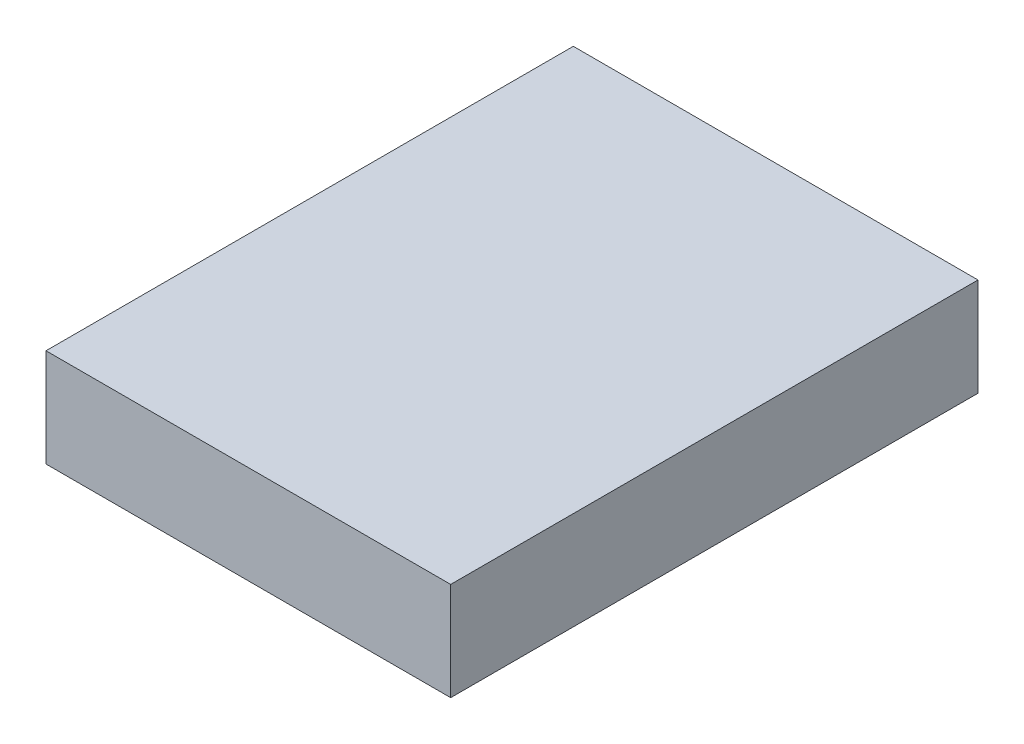
ISO-10303-21;
HEADER;
FILE_DESCRIPTION(('STEP AP214'),'2;1');
FILE_NAME('part.step','',(''),(''),'','','');
FILE_SCHEMA(('AUTOMOTIVE_DESIGN { 1 0 10303 214 1 1 1 1 }'));
ENDSEC;
DATA;
#1=APPLICATION_CONTEXT('core data for automotive mechanical design processes');
#2=APPLICATION_PROTOCOL_DEFINITION('international standard','automotive_design',2000,#1);
#3=PRODUCT_CONTEXT('',#1,'mechanical');
#4=PRODUCT('Part','Part','',(#3));
#5=PRODUCT_RELATED_PRODUCT_CATEGORY('part','',(#4));
#6=PRODUCT_DEFINITION_FORMATION('','',#4);
#7=PRODUCT_DEFINITION_CONTEXT('part definition',#1,'design');
#8=PRODUCT_DEFINITION('design','',#6,#7);
#9=PRODUCT_DEFINITION_SHAPE('','',#8);
#10=(LENGTH_UNIT() NAMED_UNIT(*) SI_UNIT(.MILLI.,.METRE.));
#11=(NAMED_UNIT(*) PLANE_ANGLE_UNIT() SI_UNIT($,.RADIAN.));
#12=(NAMED_UNIT(*) SI_UNIT($,.STERADIAN.) SOLID_ANGLE_UNIT());
#13=UNCERTAINTY_MEASURE_WITH_UNIT(LENGTH_MEASURE(1.E-05),#10,'distance_accuracy_value','');
#14=(GEOMETRIC_REPRESENTATION_CONTEXT(3) GLOBAL_UNCERTAINTY_ASSIGNED_CONTEXT((#13)) GLOBAL_UNIT_ASSIGNED_CONTEXT((#10,
#11,#12)) REPRESENTATION_CONTEXT('',''));
#15=CARTESIAN_POINT('',(0.,0.,0.));
#16=DIRECTION('',(0.,0.,1.));
#17=DIRECTION('',(1.,0.,0.));
#18=AXIS2_PLACEMENT_3D('',#15,#16,#17);
#19=CARTESIAN_POINT('',(0.,12.7,0.));
#20=DIRECTION('',(1.,0.,0.));
#21=DIRECTION('',(0.,0.,-1.));
#22=AXIS2_PLACEMENT_3D('',#19,#20,#21);
#23=PLANE('',#22);
#24=DIRECTION('',(0.,0.,1.));
#25=VECTOR('',#24,1.);
#26=CARTESIAN_POINT('',(0.,0.,0.));
#27=LINE('',#26,#25);
#28=CARTESIAN_POINT('',(0.,0.,-68.2625));
#29=VERTEX_POINT('',#28);
#30=CARTESIAN_POINT('',(0.,0.,0.));
#31=VERTEX_POINT('',#30);
#32=EDGE_CURVE('E100',#29,#31,#27,.T.);
#33=ORIENTED_EDGE('',*,*,#32,.T.);
#34=DIRECTION('',(0.,-1.,0.));
#35=VECTOR('',#34,1.);
#36=CARTESIAN_POINT('',(0.,12.7,0.));
#37=LINE('',#36,#35);
#38=CARTESIAN_POINT('',(0.,12.7,0.));
#39=VERTEX_POINT('',#38);
#40=EDGE_CURVE('E11',#39,#31,#37,.T.);
#41=ORIENTED_EDGE('',*,*,#40,.F.);
#42=DIRECTION('',(0.,0.,1.));
#43=VECTOR('',#42,1.);
#44=CARTESIAN_POINT('',(0.,12.7,0.));
#45=LINE('',#44,#43);
#46=CARTESIAN_POINT('',(0.,12.7,-68.2625));
#47=VERTEX_POINT('',#46);
#48=EDGE_CURVE('E88',#47,#39,#45,.T.);
#49=ORIENTED_EDGE('',*,*,#48,.F.);
#50=DIRECTION('',(0.,-1.,0.));
#51=VECTOR('',#50,1.);
#52=CARTESIAN_POINT('',(0.,12.7,-68.2625));
#53=LINE('',#52,#51);
#54=EDGE_CURVE('E96',#47,#29,#53,.T.);
#55=ORIENTED_EDGE('',*,*,#54,.T.);
#56=EDGE_LOOP('',(#33,#41,#49,#55));
#57=FACE_BOUND('',#56,.T.);
#58=ADVANCED_FACE('F37',(#57),#23,.F.);
#59=CARTESIAN_POINT('',(0.,12.7,0.));
#60=DIRECTION('',(0.,0.,-1.));
#61=DIRECTION('',(-1.,0.,0.));
#62=AXIS2_PLACEMENT_3D('',#59,#60,#61);
#63=PLANE('',#62);
#64=DIRECTION('',(1.,0.,0.));
#65=VECTOR('',#64,1.);
#66=CARTESIAN_POINT('',(0.,0.,0.));
#67=LINE('',#66,#65);
#68=CARTESIAN_POINT('',(52.3875,0.,0.));
#69=VERTEX_POINT('',#68);
#70=EDGE_CURVE('E92',#31,#69,#67,.T.);
#71=ORIENTED_EDGE('',*,*,#70,.T.);
#72=DIRECTION('',(0.,-1.,0.));
#73=VECTOR('',#72,1.);
#74=CARTESIAN_POINT('',(52.3875,12.7,0.));
#75=LINE('',#74,#73);
#76=CARTESIAN_POINT('',(52.3875,12.7,0.));
#77=VERTEX_POINT('',#76);
#78=EDGE_CURVE('E45',#77,#69,#75,.T.);
#79=ORIENTED_EDGE('',*,*,#78,.F.);
#80=DIRECTION('',(1.,0.,0.));
#81=VECTOR('',#80,1.);
#82=CARTESIAN_POINT('',(0.,12.7,0.));
#83=LINE('',#82,#81);
#84=EDGE_CURVE('E83',#39,#77,#83,.T.);
#85=ORIENTED_EDGE('',*,*,#84,.F.);
#86=ORIENTED_EDGE('',*,*,#40,.T.);
#87=EDGE_LOOP('',(#71,#79,#85,#86));
#88=FACE_BOUND('',#87,.T.);
#89=ADVANCED_FACE('F91',(#88),#63,.F.);
#90=CARTESIAN_POINT('',(52.3875,12.7,0.));
#91=DIRECTION('',(-1.,0.,0.));
#92=DIRECTION('',(0.,0.,1.));
#93=AXIS2_PLACEMENT_3D('',#90,#91,#92);
#94=PLANE('',#93);
#95=DIRECTION('',(0.,0.,-1.));
#96=VECTOR('',#95,1.);
#97=CARTESIAN_POINT('',(52.3875,0.,0.));
#98=LINE('',#97,#96);
#99=CARTESIAN_POINT('',(52.3875,0.,-68.2625));
#100=VERTEX_POINT('',#99);
#101=EDGE_CURVE('E70',#69,#100,#98,.T.);
#102=ORIENTED_EDGE('',*,*,#101,.T.);
#103=DIRECTION('',(0.,-1.,0.));
#104=VECTOR('',#103,1.);
#105=CARTESIAN_POINT('',(52.3875,12.7,-68.2625));
#106=LINE('',#105,#104);
#107=CARTESIAN_POINT('',(52.3875,12.7,-68.2625));
#108=VERTEX_POINT('',#107);
#109=EDGE_CURVE('E93',#108,#100,#106,.T.);
#110=ORIENTED_EDGE('',*,*,#109,.F.);
#111=DIRECTION('',(0.,0.,-1.));
#112=VECTOR('',#111,1.);
#113=CARTESIAN_POINT('',(52.3875,12.7,0.));
#114=LINE('',#113,#112);
#115=EDGE_CURVE('E86',#77,#108,#114,.T.);
#116=ORIENTED_EDGE('',*,*,#115,.F.);
#117=ORIENTED_EDGE('',*,*,#78,.T.);
#118=EDGE_LOOP('',(#102,#110,#116,#117));
#119=FACE_BOUND('',#118,.T.);
#120=ADVANCED_FACE('F94',(#119),#94,.F.);
#121=CARTESIAN_POINT('',(0.,12.7,-68.2625));
#122=DIRECTION('',(0.,0.,1.));
#123=DIRECTION('',(1.,0.,0.));
#124=AXIS2_PLACEMENT_3D('',#121,#122,#123);
#125=PLANE('',#124);
#126=DIRECTION('',(-1.,0.,0.));
#127=VECTOR('',#126,1.);
#128=CARTESIAN_POINT('',(0.,0.,-68.2625));
#129=LINE('',#128,#127);
#130=EDGE_CURVE('E76',#100,#29,#129,.T.);
#131=ORIENTED_EDGE('',*,*,#130,.T.);
#132=ORIENTED_EDGE('',*,*,#54,.F.);
#133=DIRECTION('',(-1.,0.,0.));
#134=VECTOR('',#133,1.);
#135=CARTESIAN_POINT('',(0.,12.7,-68.2625));
#136=LINE('',#135,#134);
#137=EDGE_CURVE('E53',#108,#47,#136,.T.);
#138=ORIENTED_EDGE('',*,*,#137,.F.);
#139=ORIENTED_EDGE('',*,*,#109,.T.);
#140=EDGE_LOOP('',(#131,#132,#138,#139));
#141=FACE_BOUND('',#140,.T.);
#142=ADVANCED_FACE('F107',(#141),#125,.F.);
#143=CARTESIAN_POINT('',(0.,12.7,0.));
#144=DIRECTION('',(0.,-1.,0.));
#145=DIRECTION('',(0.,0.,-1.));
#146=AXIS2_PLACEMENT_3D('',#143,#144,#145);
#147=PLANE('',#146);
#148=ORIENTED_EDGE('',*,*,#48,.T.);
#149=ORIENTED_EDGE('',*,*,#84,.T.);
#150=ORIENTED_EDGE('',*,*,#115,.T.);
#151=ORIENTED_EDGE('',*,*,#137,.T.);
#152=EDGE_LOOP('',(#148,#149,#150,#151));
#153=FACE_BOUND('',#152,.T.);
#154=ADVANCED_FACE('F84',(#153),#147,.F.);
#155=CARTESIAN_POINT('',(0.,0.,0.));
#156=DIRECTION('',(0.,-1.,0.));
#157=DIRECTION('',(0.,0.,-1.));
#158=AXIS2_PLACEMENT_3D('',#155,#156,#157);
#159=PLANE('',#158);
#160=ORIENTED_EDGE('',*,*,#32,.F.);
#161=ORIENTED_EDGE('',*,*,#130,.F.);
#162=ORIENTED_EDGE('',*,*,#101,.F.);
#163=ORIENTED_EDGE('',*,*,#70,.F.);
#164=EDGE_LOOP('',(#160,#161,#162,#163));
#165=FACE_BOUND('',#164,.T.);
#166=ADVANCED_FACE('F110',(#165),#159,.T.);
#167=CLOSED_SHELL('',(#58,#89,#120,#142,#154,#166));
#168=MANIFOLD_SOLID_BREP('B2',#167);
#169=ADVANCED_BREP_SHAPE_REPRESENTATION('',(#18,#168),#14);
#170=SHAPE_DEFINITION_REPRESENTATION(#9,#169);
ENDSEC;
END-ISO-10303-21;
